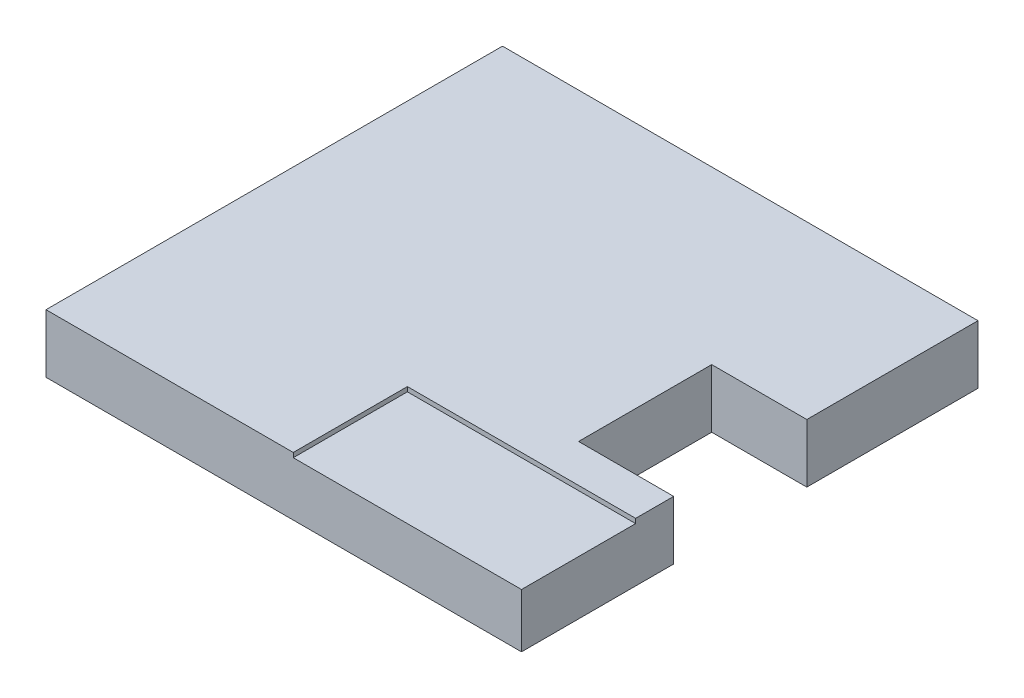
ISO-10303-21;
HEADER;
FILE_DESCRIPTION(('STEP AP214'),'2;1');
FILE_NAME('part.step','',(''),(''),'','','');
FILE_SCHEMA(('AUTOMOTIVE_DESIGN { 1 0 10303 214 1 1 1 1 }'));
ENDSEC;
DATA;
#1=APPLICATION_CONTEXT('core data for automotive mechanical design processes');
#2=APPLICATION_PROTOCOL_DEFINITION('international standard','automotive_design',2000,#1);
#3=PRODUCT_CONTEXT('',#1,'mechanical');
#4=PRODUCT('Part','Part','',(#3));
#5=PRODUCT_RELATED_PRODUCT_CATEGORY('part','',(#4));
#6=PRODUCT_DEFINITION_FORMATION('','',#4);
#7=PRODUCT_DEFINITION_CONTEXT('part definition',#1,'design');
#8=PRODUCT_DEFINITION('design','',#6,#7);
#9=PRODUCT_DEFINITION_SHAPE('','',#8);
#10=(LENGTH_UNIT() NAMED_UNIT(*) SI_UNIT(.MILLI.,.METRE.));
#11=(NAMED_UNIT(*) PLANE_ANGLE_UNIT() SI_UNIT($,.RADIAN.));
#12=(NAMED_UNIT(*) SI_UNIT($,.STERADIAN.) SOLID_ANGLE_UNIT());
#13=UNCERTAINTY_MEASURE_WITH_UNIT(LENGTH_MEASURE(1.E-05),#10,'distance_accuracy_value','');
#14=(GEOMETRIC_REPRESENTATION_CONTEXT(3) GLOBAL_UNCERTAINTY_ASSIGNED_CONTEXT((#13)) GLOBAL_UNIT_ASSIGNED_CONTEXT((#10,
#11,#12)) REPRESENTATION_CONTEXT('',''));
#15=CARTESIAN_POINT('',(0.,0.,0.));
#16=DIRECTION('',(0.,0.,1.));
#17=DIRECTION('',(1.,0.,0.));
#18=AXIS2_PLACEMENT_3D('',#15,#16,#17);
#19=CARTESIAN_POINT('',(3.125,0.71,-3.));
#20=DIRECTION('',(-1.,0.,0.));
#21=DIRECTION('',(0.,0.,1.));
#22=AXIS2_PLACEMENT_3D('',#19,#20,#21);
#23=PLANE('',#22);
#24=DIRECTION('',(0.,0.,-1.));
#25=VECTOR('',#24,1.);
#26=CARTESIAN_POINT('',(3.125,0.,-3.));
#27=LINE('',#26,#25);
#28=CARTESIAN_POINT('',(3.125,0.,3.));
#29=VERTEX_POINT('',#28);
#30=CARTESIAN_POINT('',(3.125,0.,1.));
#31=VERTEX_POINT('',#30);
#32=EDGE_CURVE('E144',#29,#31,#27,.T.);
#33=ORIENTED_EDGE('',*,*,#32,.T.);
#34=DIRECTION('',(0.,-1.,0.));
#35=VECTOR('',#34,1.);
#36=CARTESIAN_POINT('',(3.125,0.77,1.));
#37=LINE('',#36,#35);
#38=CARTESIAN_POINT('',(3.125,0.77,1.));
#39=VERTEX_POINT('',#38);
#40=EDGE_CURVE('E199',#39,#31,#37,.T.);
#41=ORIENTED_EDGE('',*,*,#40,.F.);
#42=DIRECTION('',(0.,0.,-1.));
#43=VECTOR('',#42,1.);
#44=CARTESIAN_POINT('',(3.125,0.77,1.5));
#45=LINE('',#44,#43);
#46=CARTESIAN_POINT('',(3.125,0.77,1.5));
#47=VERTEX_POINT('',#46);
#48=EDGE_CURVE('E188',#47,#39,#45,.T.);
#49=ORIENTED_EDGE('',*,*,#48,.F.);
#50=DIRECTION('',(0.,-1.,0.));
#51=VECTOR('',#50,1.);
#52=CARTESIAN_POINT('',(3.125,0.77,1.5));
#53=LINE('',#52,#51);
#54=CARTESIAN_POINT('',(3.125,0.71,1.5));
#55=VERTEX_POINT('',#54);
#56=EDGE_CURVE('E201',#47,#55,#53,.T.);
#57=ORIENTED_EDGE('',*,*,#56,.T.);
#58=DIRECTION('',(0.,0.,-1.));
#59=VECTOR('',#58,1.);
#60=CARTESIAN_POINT('',(3.125,0.71,-3.));
#61=LINE('',#60,#59);
#62=CARTESIAN_POINT('',(3.125,0.71,3.));
#63=VERTEX_POINT('',#62);
#64=EDGE_CURVE('E51',#63,#55,#61,.T.);
#65=ORIENTED_EDGE('',*,*,#64,.F.);
#66=DIRECTION('',(0.,-1.,0.));
#67=VECTOR('',#66,1.);
#68=CARTESIAN_POINT('',(3.125,0.71,3.));
#69=LINE('',#68,#67);
#70=EDGE_CURVE('E44',#63,#29,#69,.T.);
#71=ORIENTED_EDGE('',*,*,#70,.T.);
#72=EDGE_LOOP('',(#33,#41,#49,#57,#65,#71));
#73=FACE_BOUND('',#72,.T.);
#74=ADVANCED_FACE('F36',(#73),#23,.F.);
#75=CARTESIAN_POINT('',(-3.125,0.71,-3.));
#76=DIRECTION('',(1.,0.,0.));
#77=DIRECTION('',(0.,0.,-1.));
#78=AXIS2_PLACEMENT_3D('',#75,#76,#77);
#79=PLANE('',#78);
#80=DIRECTION('',(0.,0.,1.));
#81=VECTOR('',#80,1.);
#82=CARTESIAN_POINT('',(-3.125,0.,-3.));
#83=LINE('',#82,#81);
#84=CARTESIAN_POINT('',(-3.125,0.,-3.));
#85=VERTEX_POINT('',#84);
#86=CARTESIAN_POINT('',(-3.125,0.,3.));
#87=VERTEX_POINT('',#86);
#88=EDGE_CURVE('E148',#85,#87,#83,.T.);
#89=ORIENTED_EDGE('',*,*,#88,.T.);
#90=DIRECTION('',(0.,-1.,0.));
#91=VECTOR('',#90,1.);
#92=CARTESIAN_POINT('',(-3.125,0.71,3.));
#93=LINE('',#92,#91);
#94=CARTESIAN_POINT('',(-3.125,0.77,3.));
#95=VERTEX_POINT('',#94);
#96=EDGE_CURVE('E11',#95,#87,#93,.T.);
#97=ORIENTED_EDGE('',*,*,#96,.F.);
#98=DIRECTION('',(0.,0.,1.));
#99=VECTOR('',#98,1.);
#100=CARTESIAN_POINT('',(-3.125,0.77,-3.));
#101=LINE('',#100,#99);
#102=CARTESIAN_POINT('',(-3.125,0.77,-3.));
#103=VERTEX_POINT('',#102);
#104=EDGE_CURVE('E179',#103,#95,#101,.T.);
#105=ORIENTED_EDGE('',*,*,#104,.F.);
#106=DIRECTION('',(0.,-1.,0.));
#107=VECTOR('',#106,1.);
#108=CARTESIAN_POINT('',(-3.125,0.71,-3.));
#109=LINE('',#108,#107);
#110=EDGE_CURVE('E154',#103,#85,#109,.T.);
#111=ORIENTED_EDGE('',*,*,#110,.T.);
#112=EDGE_LOOP('',(#89,#97,#105,#111));
#113=FACE_BOUND('',#112,.T.);
#114=ADVANCED_FACE('F38',(#113),#79,.F.);
#115=CARTESIAN_POINT('',(-3.125,0.71,3.));
#116=DIRECTION('',(0.,0.,-1.));
#117=DIRECTION('',(-1.,0.,0.));
#118=AXIS2_PLACEMENT_3D('',#115,#116,#117);
#119=PLANE('',#118);
#120=DIRECTION('',(1.,0.,0.));
#121=VECTOR('',#120,1.);
#122=CARTESIAN_POINT('',(-3.125,0.,3.));
#123=LINE('',#122,#121);
#124=EDGE_CURVE('E145',#87,#29,#123,.T.);
#125=ORIENTED_EDGE('',*,*,#124,.T.);
#126=ORIENTED_EDGE('',*,*,#70,.F.);
#127=DIRECTION('',(1.,0.,0.));
#128=VECTOR('',#127,1.);
#129=CARTESIAN_POINT('',(-3.125,0.71,3.));
#130=LINE('',#129,#128);
#131=CARTESIAN_POINT('',(0.125000000000001,0.71,3.));
#132=VERTEX_POINT('',#131);
#133=EDGE_CURVE('E153',#132,#63,#130,.T.);
#134=ORIENTED_EDGE('',*,*,#133,.F.);
#135=DIRECTION('',(0.,-1.,0.));
#136=VECTOR('',#135,1.);
#137=CARTESIAN_POINT('',(0.125000000000001,0.77,3.));
#138=LINE('',#137,#136);
#139=CARTESIAN_POINT('',(0.125000000000001,0.77,3.));
#140=VERTEX_POINT('',#139);
#141=EDGE_CURVE('E206',#140,#132,#138,.T.);
#142=ORIENTED_EDGE('',*,*,#141,.F.);
#143=DIRECTION('',(1.,0.,0.));
#144=VECTOR('',#143,1.);
#145=CARTESIAN_POINT('',(-3.125,0.77,3.));
#146=LINE('',#145,#144);
#147=EDGE_CURVE('E182',#95,#140,#146,.T.);
#148=ORIENTED_EDGE('',*,*,#147,.F.);
#149=ORIENTED_EDGE('',*,*,#96,.T.);
#150=EDGE_LOOP('',(#125,#126,#134,#142,#148,#149));
#151=FACE_BOUND('',#150,.T.);
#152=ADVANCED_FACE('F235',(#151),#119,.F.);
#153=DIRECTION('',(0.,-1.,0.));
#154=VECTOR('',#153,1.);
#155=CARTESIAN_POINT('',(3.125,0.77,-0.75));
#156=LINE('',#155,#154);
#157=CARTESIAN_POINT('',(3.125,0.77,-0.75));
#158=VERTEX_POINT('',#157);
#159=CARTESIAN_POINT('',(3.125,0.,-0.75));
#160=VERTEX_POINT('',#159);
#161=EDGE_CURVE('E118',#158,#160,#156,.T.);
#162=ORIENTED_EDGE('',*,*,#161,.T.);
#163=CARTESIAN_POINT('',(3.125,0.,-3.));
#164=VERTEX_POINT('',#163);
#165=EDGE_CURVE('E122',#160,#164,#27,.T.);
#166=ORIENTED_EDGE('',*,*,#165,.T.);
#167=DIRECTION('',(0.,-1.,0.));
#168=VECTOR('',#167,1.);
#169=CARTESIAN_POINT('',(3.125,0.71,-3.));
#170=LINE('',#169,#168);
#171=CARTESIAN_POINT('',(3.125,0.77,-3.));
#172=VERTEX_POINT('',#171);
#173=EDGE_CURVE('E157',#172,#164,#170,.T.);
#174=ORIENTED_EDGE('',*,*,#173,.F.);
#175=DIRECTION('',(0.,0.,-1.));
#176=VECTOR('',#175,1.);
#177=CARTESIAN_POINT('',(3.125,0.77,-0.75));
#178=LINE('',#177,#176);
#179=EDGE_CURVE('E125',#158,#172,#178,.T.);
#180=ORIENTED_EDGE('',*,*,#179,.F.);
#181=EDGE_LOOP('',(#162,#166,#174,#180));
#182=FACE_BOUND('',#181,.T.);
#183=ADVANCED_FACE('F120',(#182),#23,.F.);
#184=CARTESIAN_POINT('',(-3.125,0.71,-3.));
#185=DIRECTION('',(0.,0.,1.));
#186=DIRECTION('',(1.,0.,0.));
#187=AXIS2_PLACEMENT_3D('',#184,#185,#186);
#188=PLANE('',#187);
#189=DIRECTION('',(-1.,0.,0.));
#190=VECTOR('',#189,1.);
#191=CARTESIAN_POINT('',(-3.125,0.,-3.));
#192=LINE('',#191,#190);
#193=EDGE_CURVE('E143',#164,#85,#192,.T.);
#194=ORIENTED_EDGE('',*,*,#193,.T.);
#195=ORIENTED_EDGE('',*,*,#110,.F.);
#196=DIRECTION('',(-1.,0.,0.));
#197=VECTOR('',#196,1.);
#198=CARTESIAN_POINT('',(3.125,0.77,-3.));
#199=LINE('',#198,#197);
#200=EDGE_CURVE('E176',#172,#103,#199,.T.);
#201=ORIENTED_EDGE('',*,*,#200,.F.);
#202=ORIENTED_EDGE('',*,*,#173,.T.);
#203=EDGE_LOOP('',(#194,#195,#201,#202));
#204=FACE_BOUND('',#203,.T.);
#205=ADVANCED_FACE('F215',(#204),#188,.F.);
#206=CARTESIAN_POINT('',(0.,0.71,0.));
#207=DIRECTION('',(0.,1.,0.));
#208=DIRECTION('',(0.,0.,1.));
#209=AXIS2_PLACEMENT_3D('',#206,#207,#208);
#210=PLANE('',#209);
#211=DIRECTION('',(1.,0.,0.));
#212=VECTOR('',#211,1.);
#213=CARTESIAN_POINT('',(0.125000000000001,0.71,1.5));
#214=LINE('',#213,#212);
#215=CARTESIAN_POINT('',(0.125000000000001,0.71,1.5));
#216=VERTEX_POINT('',#215);
#217=EDGE_CURVE('E171',#216,#55,#214,.T.);
#218=ORIENTED_EDGE('',*,*,#217,.F.);
#219=DIRECTION('',(0.,0.,-1.));
#220=VECTOR('',#219,1.);
#221=CARTESIAN_POINT('',(0.125000000000001,0.71,3.));
#222=LINE('',#221,#220);
#223=EDGE_CURVE('E56',#132,#216,#222,.T.);
#224=ORIENTED_EDGE('',*,*,#223,.F.);
#225=ORIENTED_EDGE('',*,*,#133,.T.);
#226=ORIENTED_EDGE('',*,*,#64,.T.);
#227=EDGE_LOOP('',(#218,#224,#225,#226));
#228=FACE_BOUND('',#227,.T.);
#229=ADVANCED_FACE('F231',(#228),#210,.T.);
#230=CARTESIAN_POINT('',(0.,0.,0.));
#231=DIRECTION('',(0.,1.,0.));
#232=DIRECTION('',(0.,0.,1.));
#233=AXIS2_PLACEMENT_3D('',#230,#231,#232);
#234=PLANE('',#233);
#235=DIRECTION('',(0.,0.,1.));
#236=VECTOR('',#235,1.);
#237=CARTESIAN_POINT('',(1.875,0.,-0.75));
#238=LINE('',#237,#236);
#239=CARTESIAN_POINT('',(1.875,0.,-0.75));
#240=VERTEX_POINT('',#239);
#241=CARTESIAN_POINT('',(1.875,0.,1.));
#242=VERTEX_POINT('',#241);
#243=EDGE_CURVE('E138',#240,#242,#238,.T.);
#244=ORIENTED_EDGE('',*,*,#243,.T.);
#245=DIRECTION('',(1.,0.,0.));
#246=VECTOR('',#245,1.);
#247=CARTESIAN_POINT('',(3.125,0.,1.));
#248=LINE('',#247,#246);
#249=EDGE_CURVE('E167',#242,#31,#248,.T.);
#250=ORIENTED_EDGE('',*,*,#249,.T.);
#251=ORIENTED_EDGE('',*,*,#32,.F.);
#252=ORIENTED_EDGE('',*,*,#124,.F.);
#253=ORIENTED_EDGE('',*,*,#88,.F.);
#254=ORIENTED_EDGE('',*,*,#193,.F.);
#255=ORIENTED_EDGE('',*,*,#165,.F.);
#256=DIRECTION('',(-1.,0.,0.));
#257=VECTOR('',#256,1.);
#258=CARTESIAN_POINT('',(3.125,0.,-0.75));
#259=LINE('',#258,#257);
#260=EDGE_CURVE('E132',#160,#240,#259,.T.);
#261=ORIENTED_EDGE('',*,*,#260,.T.);
#262=EDGE_LOOP('',(#244,#250,#251,#252,#253,#254,#255,#261));
#263=FACE_BOUND('',#262,.T.);
#264=ADVANCED_FACE('F141',(#263),#234,.F.);
#265=CARTESIAN_POINT('',(0.125000000000001,0.77,3.));
#266=DIRECTION('',(-1.,0.,0.));
#267=DIRECTION('',(0.,0.,1.));
#268=AXIS2_PLACEMENT_3D('',#265,#266,#267);
#269=PLANE('',#268);
#270=ORIENTED_EDGE('',*,*,#223,.T.);
#271=DIRECTION('',(0.,-1.,0.));
#272=VECTOR('',#271,1.);
#273=CARTESIAN_POINT('',(0.125000000000001,0.77,1.5));
#274=LINE('',#273,#272);
#275=CARTESIAN_POINT('',(0.125000000000001,0.77,1.5));
#276=VERTEX_POINT('',#275);
#277=EDGE_CURVE('E203',#276,#216,#274,.T.);
#278=ORIENTED_EDGE('',*,*,#277,.F.);
#279=DIRECTION('',(0.,0.,-1.));
#280=VECTOR('',#279,1.);
#281=CARTESIAN_POINT('',(0.125000000000001,0.77,3.));
#282=LINE('',#281,#280);
#283=EDGE_CURVE('E184',#140,#276,#282,.T.);
#284=ORIENTED_EDGE('',*,*,#283,.F.);
#285=ORIENTED_EDGE('',*,*,#141,.T.);
#286=EDGE_LOOP('',(#270,#278,#284,#285));
#287=FACE_BOUND('',#286,.T.);
#288=ADVANCED_FACE('F233',(#287),#269,.F.);
#289=CARTESIAN_POINT('',(0.125000000000001,0.77,1.5));
#290=DIRECTION('',(0.,0.,-1.));
#291=DIRECTION('',(-1.,0.,0.));
#292=AXIS2_PLACEMENT_3D('',#289,#290,#291);
#293=PLANE('',#292);
#294=ORIENTED_EDGE('',*,*,#217,.T.);
#295=ORIENTED_EDGE('',*,*,#56,.F.);
#296=DIRECTION('',(1.,0.,0.));
#297=VECTOR('',#296,1.);
#298=CARTESIAN_POINT('',(0.125000000000001,0.77,1.5));
#299=LINE('',#298,#297);
#300=EDGE_CURVE('E186',#276,#47,#299,.T.);
#301=ORIENTED_EDGE('',*,*,#300,.F.);
#302=ORIENTED_EDGE('',*,*,#277,.T.);
#303=EDGE_LOOP('',(#294,#295,#301,#302));
#304=FACE_BOUND('',#303,.T.);
#305=ADVANCED_FACE('F230',(#304),#293,.F.);
#306=CARTESIAN_POINT('',(3.125,0.77,1.));
#307=DIRECTION('',(0.,0.,1.));
#308=DIRECTION('',(1.,0.,0.));
#309=AXIS2_PLACEMENT_3D('',#306,#307,#308);
#310=PLANE('',#309);
#311=ORIENTED_EDGE('',*,*,#40,.T.);
#312=ORIENTED_EDGE('',*,*,#249,.F.);
#313=DIRECTION('',(0.,-1.,0.));
#314=VECTOR('',#313,1.);
#315=CARTESIAN_POINT('',(1.875,0.77,1.));
#316=LINE('',#315,#314);
#317=CARTESIAN_POINT('',(1.875,0.77,1.));
#318=VERTEX_POINT('',#317);
#319=EDGE_CURVE('E197',#318,#242,#316,.T.);
#320=ORIENTED_EDGE('',*,*,#319,.F.);
#321=DIRECTION('',(-1.,0.,0.));
#322=VECTOR('',#321,1.);
#323=CARTESIAN_POINT('',(3.125,0.77,1.));
#324=LINE('',#323,#322);
#325=EDGE_CURVE('E190',#39,#318,#324,.T.);
#326=ORIENTED_EDGE('',*,*,#325,.F.);
#327=EDGE_LOOP('',(#311,#312,#320,#326));
#328=FACE_BOUND('',#327,.T.);
#329=ADVANCED_FACE('F223',(#328),#310,.F.);
#330=CARTESIAN_POINT('',(1.875,0.77,1.));
#331=DIRECTION('',(-1.,0.,0.));
#332=DIRECTION('',(0.,0.,1.));
#333=AXIS2_PLACEMENT_3D('',#330,#331,#332);
#334=PLANE('',#333);
#335=ORIENTED_EDGE('',*,*,#319,.T.);
#336=ORIENTED_EDGE('',*,*,#243,.F.);
#337=DIRECTION('',(0.,-1.,0.));
#338=VECTOR('',#337,1.);
#339=CARTESIAN_POINT('',(1.875,0.77,-0.75));
#340=LINE('',#339,#338);
#341=CARTESIAN_POINT('',(1.875,0.77,-0.75));
#342=VERTEX_POINT('',#341);
#343=EDGE_CURVE('E128',#342,#240,#340,.T.);
#344=ORIENTED_EDGE('',*,*,#343,.F.);
#345=DIRECTION('',(0.,0.,-1.));
#346=VECTOR('',#345,1.);
#347=CARTESIAN_POINT('',(1.875,0.77,1.));
#348=LINE('',#347,#346);
#349=EDGE_CURVE('E192',#318,#342,#348,.T.);
#350=ORIENTED_EDGE('',*,*,#349,.F.);
#351=EDGE_LOOP('',(#335,#336,#344,#350));
#352=FACE_BOUND('',#351,.T.);
#353=ADVANCED_FACE('F222',(#352),#334,.F.);
#354=CARTESIAN_POINT('',(1.875,0.77,-0.75));
#355=DIRECTION('',(0.,0.,-1.));
#356=DIRECTION('',(-1.,0.,0.));
#357=AXIS2_PLACEMENT_3D('',#354,#355,#356);
#358=PLANE('',#357);
#359=ORIENTED_EDGE('',*,*,#343,.T.);
#360=ORIENTED_EDGE('',*,*,#260,.F.);
#361=ORIENTED_EDGE('',*,*,#161,.F.);
#362=DIRECTION('',(1.,0.,0.));
#363=VECTOR('',#362,1.);
#364=CARTESIAN_POINT('',(1.875,0.77,-0.75));
#365=LINE('',#364,#363);
#366=EDGE_CURVE('E129',#342,#158,#365,.T.);
#367=ORIENTED_EDGE('',*,*,#366,.F.);
#368=EDGE_LOOP('',(#359,#360,#361,#367));
#369=FACE_BOUND('',#368,.T.);
#370=ADVANCED_FACE('F133',(#369),#358,.F.);
#371=CARTESIAN_POINT('',(0.,0.77,0.));
#372=DIRECTION('',(0.,1.,0.));
#373=DIRECTION('',(0.,0.,1.));
#374=AXIS2_PLACEMENT_3D('',#371,#372,#373);
#375=PLANE('',#374);
#376=ORIENTED_EDGE('',*,*,#179,.T.);
#377=ORIENTED_EDGE('',*,*,#200,.T.);
#378=ORIENTED_EDGE('',*,*,#104,.T.);
#379=ORIENTED_EDGE('',*,*,#147,.T.);
#380=ORIENTED_EDGE('',*,*,#283,.T.);
#381=ORIENTED_EDGE('',*,*,#300,.T.);
#382=ORIENTED_EDGE('',*,*,#48,.T.);
#383=ORIENTED_EDGE('',*,*,#325,.T.);
#384=ORIENTED_EDGE('',*,*,#349,.T.);
#385=ORIENTED_EDGE('',*,*,#366,.T.);
#386=EDGE_LOOP('',(#376,#377,#378,#379,#380,#381,#382,#383,#384,#385));
#387=FACE_BOUND('',#386,.T.);
#388=ADVANCED_FACE('F217',(#387),#375,.T.);
#389=CLOSED_SHELL('',(#74,#114,#152,#183,#205,#229,#264,#288,#305,#329,#353,#370,#388));
#390=MANIFOLD_SOLID_BREP('B2',#389);
#391=ADVANCED_BREP_SHAPE_REPRESENTATION('',(#18,#390),#14);
#392=SHAPE_DEFINITION_REPRESENTATION(#9,#391);
ENDSEC;
END-ISO-10303-21;
